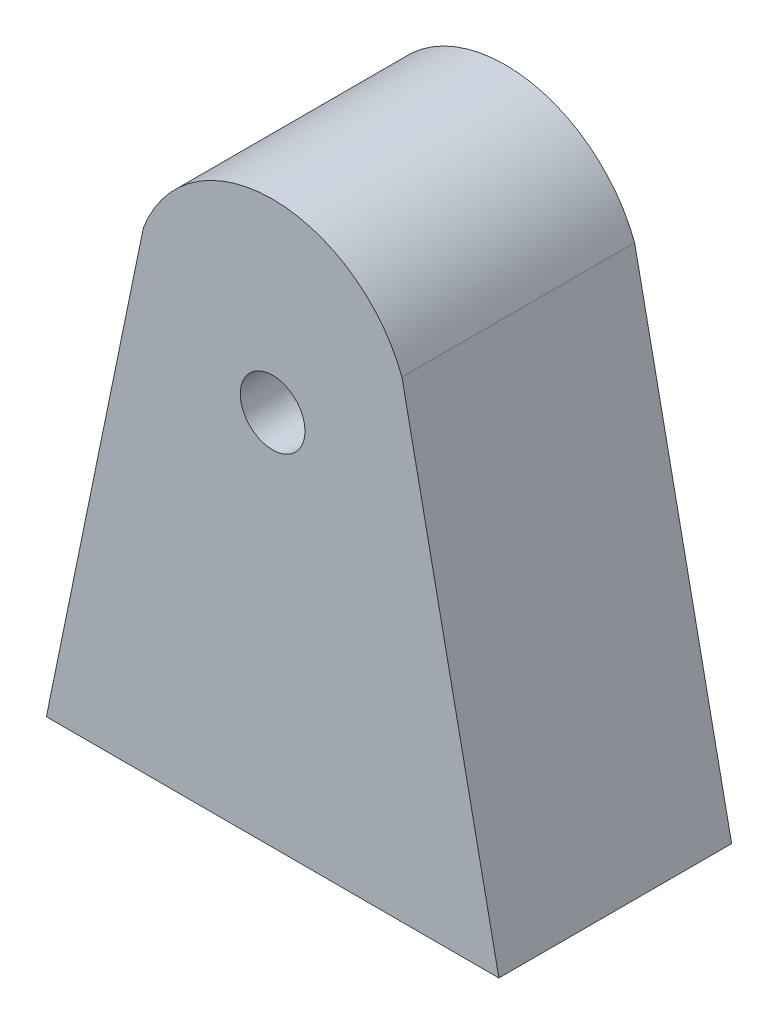
ISO-10303-21;
HEADER;
FILE_DESCRIPTION(('STEP AP214'),'2;1');
FILE_NAME('part.step','',(''),(''),'','','');
FILE_SCHEMA(('AUTOMOTIVE_DESIGN { 1 0 10303 214 1 1 1 1 }'));
ENDSEC;
DATA;
#1=APPLICATION_CONTEXT('core data for automotive mechanical design processes');
#2=APPLICATION_PROTOCOL_DEFINITION('international standard','automotive_design',2000,#1);
#3=PRODUCT_CONTEXT('',#1,'mechanical');
#4=PRODUCT('Part','Part','',(#3));
#5=PRODUCT_RELATED_PRODUCT_CATEGORY('part','',(#4));
#6=PRODUCT_DEFINITION_FORMATION('','',#4);
#7=PRODUCT_DEFINITION_CONTEXT('part definition',#1,'design');
#8=PRODUCT_DEFINITION('design','',#6,#7);
#9=PRODUCT_DEFINITION_SHAPE('','',#8);
#10=(LENGTH_UNIT() NAMED_UNIT(*) SI_UNIT(.MILLI.,.METRE.));
#11=(NAMED_UNIT(*) PLANE_ANGLE_UNIT() SI_UNIT($,.RADIAN.));
#12=(NAMED_UNIT(*) SI_UNIT($,.STERADIAN.) SOLID_ANGLE_UNIT());
#13=UNCERTAINTY_MEASURE_WITH_UNIT(LENGTH_MEASURE(1.E-05),#10,'distance_accuracy_value','');
#14=(GEOMETRIC_REPRESENTATION_CONTEXT(3) GLOBAL_UNCERTAINTY_ASSIGNED_CONTEXT((#13)) GLOBAL_UNIT_ASSIGNED_CONTEXT((#10,
#11,#12)) REPRESENTATION_CONTEXT('',''));
#15=CARTESIAN_POINT('',(0.,0.,0.));
#16=DIRECTION('',(0.,0.,1.));
#17=DIRECTION('',(1.,0.,0.));
#18=AXIS2_PLACEMENT_3D('',#15,#16,#17);
#19=CARTESIAN_POINT('',(-3.43567739367662,-41.9594853665981,22.86));
#20=DIRECTION('',(0.979534918634303,-0.201274298349514,0.));
#21=DIRECTION('',(0.201274298349514,0.979534918634303,0.));
#22=AXIS2_PLACEMENT_3D('',#19,#20,#21);
#23=PLANE('',#22);
#24=DIRECTION('',(0.,0.,1.));
#25=VECTOR('',#24,1.);
#26=CARTESIAN_POINT('',(-3.6912957525805,-43.2034947132637,17.78));
#27=LINE('',#26,#25);
#28=CARTESIAN_POINT('',(-3.6912957525805,-43.2034947132637,17.78));
#29=VERTEX_POINT('',#28);
#30=CARTESIAN_POINT('',(-3.6912957525805,-43.2034947132637,22.86));
#31=VERTEX_POINT('',#30);
#32=EDGE_CURVE('E180',#29,#31,#27,.T.);
#33=ORIENTED_EDGE('',*,*,#32,.F.);
#34=DIRECTION('',(-0.201274298349514,-0.979534918634303,0.));
#35=VECTOR('',#34,1.);
#36=CARTESIAN_POINT('',(-3.43567739367662,-41.9594853665981,17.78));
#37=LINE('',#36,#35);
#38=CARTESIAN_POINT('',(-3.94691411148438,-44.4475040599292,17.78));
#39=VERTEX_POINT('',#38);
#40=EDGE_CURVE('E186',#29,#39,#37,.T.);
#41=ORIENTED_EDGE('',*,*,#40,.T.);
#42=DIRECTION('',(0.,0.,1.));
#43=VECTOR('',#42,1.);
#44=CARTESIAN_POINT('',(-3.94691411148438,-44.4475040599292,22.86));
#45=LINE('',#44,#43);
#46=CARTESIAN_POINT('',(-3.94691411148438,-44.4475040599292,22.86));
#47=VERTEX_POINT('',#46);
#48=EDGE_CURVE('E187',#39,#47,#45,.T.);
#49=ORIENTED_EDGE('',*,*,#48,.T.);
#50=DIRECTION('',(-0.201274298349514,-0.979534918634303,0.));
#51=VECTOR('',#50,1.);
#52=CARTESIAN_POINT('',(-3.43567739367662,-41.9594853665981,22.86));
#53=LINE('',#52,#51);
#54=EDGE_CURVE('E201',#31,#47,#53,.T.);
#55=ORIENTED_EDGE('',*,*,#54,.F.);
#56=EDGE_LOOP('',(#33,#41,#49,#55));
#57=FACE_BOUND('',#56,.T.);
#58=ADVANCED_FACE('F36',(#57),#23,.F.);
#59=CARTESIAN_POINT('',(-1.45889541815325,-44.958740777737,17.78));
#60=DIRECTION('',(-0.201274298349514,-0.979534918634303,0.));
#61=DIRECTION('',(0.979534918634303,-0.201274298349514,0.));
#62=AXIS2_PLACEMENT_3D('',#59,#60,#61);
#63=PLANE('',#62);
#64=ORIENTED_EDGE('',*,*,#48,.F.);
#65=DIRECTION('',(-0.979534918634303,0.201274298349514,0.));
#66=VECTOR('',#65,1.);
#67=CARTESIAN_POINT('',(-1.45889541815325,-44.958740777737,17.78));
#68=LINE('',#67,#66);
#69=CARTESIAN_POINT('',(-6.43493280481551,-43.9362673421214,17.78));
#70=VERTEX_POINT('',#69);
#71=EDGE_CURVE('E226',#39,#70,#68,.T.);
#72=ORIENTED_EDGE('',*,*,#71,.T.);
#73=DIRECTION('',(0.,0.,1.));
#74=VECTOR('',#73,1.);
#75=CARTESIAN_POINT('',(-6.43493280481551,-43.9362673421214,17.78));
#76=LINE('',#75,#74);
#77=CARTESIAN_POINT('',(-6.43493280481551,-43.9362673421214,22.86));
#78=VERTEX_POINT('',#77);
#79=EDGE_CURVE('E215',#70,#78,#76,.T.);
#80=ORIENTED_EDGE('',*,*,#79,.T.);
#81=DIRECTION('',(-0.979534918634303,0.201274298349514,0.));
#82=VECTOR('',#81,1.);
#83=CARTESIAN_POINT('',(-1.45889541815325,-44.958740777737,22.86));
#84=LINE('',#83,#82);
#85=EDGE_CURVE('E224',#47,#78,#84,.T.);
#86=ORIENTED_EDGE('',*,*,#85,.F.);
#87=EDGE_LOOP('',(#64,#72,#80,#86));
#88=FACE_BOUND('',#87,.T.);
#89=ADVANCED_FACE('F309',(#88),#63,.F.);
#90=CARTESIAN_POINT('',(2.48801869333113,-0.511236717807766,45.72));
#91=DIRECTION('',(0.979534918634303,-0.201274298349514,0.));
#92=DIRECTION('',(0.201274298349514,0.979534918634303,0.));
#93=AXIS2_PLACEMENT_3D('',#90,#91,#92);
#94=PLANE('',#93);
#95=DIRECTION('',(0.201274298349514,0.979534918634303,0.));
#96=VECTOR('',#95,1.);
#97=CARTESIAN_POINT('',(2.48801869333114,-0.511236717807768,30.48));
#98=LINE('',#97,#96);
#99=CARTESIAN_POINT('',(-16.4569326660234,-92.71,30.48));
#100=VERTEX_POINT('',#99);
#101=CARTESIAN_POINT('',(2.44652287467715,-0.713183035257189,30.48));
#102=VERTEX_POINT('',#101);
#103=EDGE_CURVE('E237',#100,#102,#98,.T.);
#104=ORIENTED_EDGE('',*,*,#103,.F.);
#105=DIRECTION('',(0.,0.,-1.));
#106=VECTOR('',#105,1.);
#107=CARTESIAN_POINT('',(-16.4569326660234,-92.71,45.72));
#108=LINE('',#107,#106);
#109=CARTESIAN_POINT('',(-16.4569326660234,-92.71,10.16));
#110=VERTEX_POINT('',#109);
#111=EDGE_CURVE('E252',#100,#110,#108,.T.);
#112=ORIENTED_EDGE('',*,*,#111,.T.);
#113=DIRECTION('',(-0.201274298349514,-0.979534918634303,0.));
#114=VECTOR('',#113,1.);
#115=CARTESIAN_POINT('',(1.62779937202775,-4.6976374148176,10.16));
#116=LINE('',#115,#114);
#117=CARTESIAN_POINT('',(2.44652287467714,-0.713183035257189,10.16));
#118=VERTEX_POINT('',#117);
#119=EDGE_CURVE('E248',#118,#110,#116,.T.);
#120=ORIENTED_EDGE('',*,*,#119,.F.);
#121=DIRECTION('',(0.,0.,-1.));
#122=VECTOR('',#121,1.);
#123=CARTESIAN_POINT('',(2.44652287467714,-0.713183035257189,35.56));
#124=LINE('',#123,#122);
#125=EDGE_CURVE('E249',#102,#118,#124,.T.);
#126=ORIENTED_EDGE('',*,*,#125,.F.);
#127=EDGE_LOOP('',(#104,#112,#120,#126));
#128=FACE_BOUND('',#127,.T.);
#129=ORIENTED_EDGE('',*,*,#79,.F.);
#130=DIRECTION('',(0.201274298349514,0.979534918634303,0.));
#131=VECTOR('',#130,1.);
#132=CARTESIAN_POINT('',(-6.43493280481551,-43.9362673421214,17.78));
#133=LINE('',#132,#131);
#134=CARTESIAN_POINT('',(-6.94616952262327,-46.4242860354526,17.78));
#135=VERTEX_POINT('',#134);
#136=EDGE_CURVE('E205',#135,#70,#133,.T.);
#137=ORIENTED_EDGE('',*,*,#136,.F.);
#138=DIRECTION('',(0.,0.,-1.));
#139=VECTOR('',#138,1.);
#140=CARTESIAN_POINT('',(-6.94616952262327,-46.4242860354526,17.78));
#141=LINE('',#140,#139);
#142=CARTESIAN_POINT('',(-6.94616952262328,-46.4242860354526,22.86));
#143=VERTEX_POINT('',#142);
#144=EDGE_CURVE('E209',#143,#135,#141,.T.);
#145=ORIENTED_EDGE('',*,*,#144,.F.);
#146=DIRECTION('',(-0.201274298349515,-0.979534918634303,0.));
#147=VECTOR('',#146,1.);
#148=CARTESIAN_POINT('',(-6.43493280481551,-43.9362673421214,22.86));
#149=LINE('',#148,#147);
#150=EDGE_CURVE('E218',#78,#143,#149,.T.);
#151=ORIENTED_EDGE('',*,*,#150,.F.);
#152=EDGE_LOOP('',(#129,#137,#145,#151));
#153=FACE_BOUND('',#152,.T.);
#154=ADVANCED_FACE('F315',(#128,#153),#94,.T.);
#155=CARTESIAN_POINT('',(69.85,-92.71,45.72));
#156=DIRECTION('',(0.,1.,0.));
#157=DIRECTION('',(0.,0.,1.));
#158=AXIS2_PLACEMENT_3D('',#155,#156,#157);
#159=PLANE('',#158);
#160=ORIENTED_EDGE('',*,*,#111,.F.);
#161=DIRECTION('',(-1.,0.,0.));
#162=VECTOR('',#161,1.);
#163=CARTESIAN_POINT('',(0.,-92.71,30.48));
#164=LINE('',#163,#162);
#165=CARTESIAN_POINT('',(67.2569326660234,-92.71,30.48));
#166=VERTEX_POINT('',#165);
#167=EDGE_CURVE('E243',#166,#100,#164,.T.);
#168=ORIENTED_EDGE('',*,*,#167,.F.);
#169=DIRECTION('',(0.,0.,-1.));
#170=VECTOR('',#169,1.);
#171=CARTESIAN_POINT('',(67.2569326660234,-92.71,45.72));
#172=LINE('',#171,#170);
#173=CARTESIAN_POINT('',(67.2569326660234,-92.71,10.16));
#174=VERTEX_POINT('',#173);
#175=EDGE_CURVE('E255',#166,#174,#172,.T.);
#176=ORIENTED_EDGE('',*,*,#175,.T.);
#177=DIRECTION('',(1.,0.,0.));
#178=VECTOR('',#177,1.);
#179=CARTESIAN_POINT('',(25.4,-92.71,10.16));
#180=LINE('',#179,#178);
#181=EDGE_CURVE('E259',#110,#174,#180,.T.);
#182=ORIENTED_EDGE('',*,*,#181,.F.);
#183=EDGE_LOOP('',(#160,#168,#176,#182));
#184=FACE_BOUND('',#183,.T.);
#185=DIRECTION('',(1.,0.,0.));
#186=VECTOR('',#185,1.);
#187=CARTESIAN_POINT('',(69.85,-92.71,0.));
#188=LINE('',#187,#186);
#189=CARTESIAN_POINT('',(-19.05,-92.71,0.));
#190=VERTEX_POINT('',#189);
#191=CARTESIAN_POINT('',(69.85,-92.71,0.));
#192=VERTEX_POINT('',#191);
#193=EDGE_CURVE('E277',#190,#192,#188,.T.);
#194=ORIENTED_EDGE('',*,*,#193,.T.);
#195=DIRECTION('',(0.,0.,-1.));
#196=VECTOR('',#195,1.);
#197=CARTESIAN_POINT('',(69.85,-92.71,45.72));
#198=LINE('',#197,#196);
#199=CARTESIAN_POINT('',(69.85,-92.71,45.72));
#200=VERTEX_POINT('',#199);
#201=EDGE_CURVE('E281',#200,#192,#198,.T.);
#202=ORIENTED_EDGE('',*,*,#201,.F.);
#203=DIRECTION('',(1.,0.,0.));
#204=VECTOR('',#203,1.);
#205=CARTESIAN_POINT('',(69.85,-92.71,45.72));
#206=LINE('',#205,#204);
#207=CARTESIAN_POINT('',(-19.05,-92.71,45.72));
#208=VERTEX_POINT('',#207);
#209=EDGE_CURVE('E269',#208,#200,#206,.T.);
#210=ORIENTED_EDGE('',*,*,#209,.F.);
#211=DIRECTION('',(0.,0.,-1.));
#212=VECTOR('',#211,1.);
#213=CARTESIAN_POINT('',(-19.05,-92.71,45.72));
#214=LINE('',#213,#212);
#215=EDGE_CURVE('E45',#208,#190,#214,.T.);
#216=ORIENTED_EDGE('',*,*,#215,.T.);
#217=EDGE_LOOP('',(#194,#202,#210,#216));
#218=FACE_BOUND('',#217,.T.);
#219=ADVANCED_FACE('F287',(#184,#218),#159,.F.);
#220=CARTESIAN_POINT('',(25.4,-9.58233617398998,45.72));
#221=DIRECTION('',(0.,0.,-1.));
#222=DIRECTION('',(-1.,0.,0.));
#223=AXIS2_PLACEMENT_3D('',#220,#221,#222);
#224=CYLINDRICAL_SURFACE('',#223,27.1473970492818);
#225=CARTESIAN_POINT('',(25.4,-9.58233617398998,0.));
#226=DIRECTION('',(0.,0.,1.));
#227=DIRECTION('',(-1.,0.,0.));
#228=AXIS2_PLACEMENT_3D('',#225,#226,#227);
#229=CIRCLE('',#228,27.1473970492818);
#230=CARTESIAN_POINT('',(50.8,0.,0.));
#231=VERTEX_POINT('',#230);
#232=CARTESIAN_POINT('',(0.,0.,0.));
#233=VERTEX_POINT('',#232);
#234=EDGE_CURVE('E251',#231,#233,#229,.T.);
#235=ORIENTED_EDGE('',*,*,#234,.T.);
#236=DIRECTION('',(0.,0.,-1.));
#237=VECTOR('',#236,1.);
#238=CARTESIAN_POINT('',(0.,0.,45.72));
#239=LINE('',#238,#237);
#240=CARTESIAN_POINT('',(0.,0.,45.72));
#241=VERTEX_POINT('',#240);
#242=EDGE_CURVE('E11',#241,#233,#239,.T.);
#243=ORIENTED_EDGE('',*,*,#242,.F.);
#244=CARTESIAN_POINT('',(25.4,-9.58233617398998,45.72));
#245=DIRECTION('',(0.,0.,1.));
#246=DIRECTION('',(-1.,0.,0.));
#247=AXIS2_PLACEMENT_3D('',#244,#245,#246);
#248=CIRCLE('',#247,27.1473970492818);
#249=CARTESIAN_POINT('',(50.8,0.,45.72));
#250=VERTEX_POINT('',#249);
#251=EDGE_CURVE('E266',#250,#241,#248,.T.);
#252=ORIENTED_EDGE('',*,*,#251,.F.);
#253=DIRECTION('',(0.,0.,-1.));
#254=VECTOR('',#253,1.);
#255=CARTESIAN_POINT('',(50.8,0.,45.72));
#256=LINE('',#255,#254);
#257=EDGE_CURVE('E272',#250,#231,#256,.T.);
#258=ORIENTED_EDGE('',*,*,#257,.T.);
#259=EDGE_LOOP('',(#235,#243,#252,#258));
#260=FACE_BOUND('',#259,.T.);
#261=ADVANCED_FACE('F38',(#260),#224,.T.);
#262=CARTESIAN_POINT('',(0.,0.,45.72));
#263=DIRECTION('',(0.979534918634303,-0.201274298349514,0.));
#264=DIRECTION('',(0.201274298349514,0.979534918634303,0.));
#265=AXIS2_PLACEMENT_3D('',#262,#263,#264);
#266=PLANE('',#265);
#267=DIRECTION('',(-0.201274298349514,-0.979534918634303,0.));
#268=VECTOR('',#267,1.);
#269=CARTESIAN_POINT('',(0.,0.,0.));
#270=LINE('',#269,#268);
#271=EDGE_CURVE('E275',#233,#190,#270,.T.);
#272=ORIENTED_EDGE('',*,*,#271,.T.);
#273=ORIENTED_EDGE('',*,*,#215,.F.);
#274=DIRECTION('',(-0.201274298349514,-0.979534918634303,0.));
#275=VECTOR('',#274,1.);
#276=CARTESIAN_POINT('',(0.,0.,45.72));
#277=LINE('',#276,#275);
#278=EDGE_CURVE('E89',#241,#208,#277,.T.);
#279=ORIENTED_EDGE('',*,*,#278,.F.);
#280=ORIENTED_EDGE('',*,*,#242,.T.);
#281=EDGE_LOOP('',(#272,#273,#279,#280));
#282=FACE_BOUND('',#281,.T.);
#283=ADVANCED_FACE('F298',(#282),#266,.F.);
#284=CARTESIAN_POINT('',(50.8,0.,45.72));
#285=DIRECTION('',(-0.979534918634303,-0.201274298349514,0.));
#286=DIRECTION('',(0.201274298349514,-0.979534918634303,0.));
#287=AXIS2_PLACEMENT_3D('',#284,#285,#286);
#288=PLANE('',#287);
#289=DIRECTION('',(-0.201274298349514,0.979534918634303,0.));
#290=VECTOR('',#289,1.);
#291=CARTESIAN_POINT('',(50.8,0.,0.));
#292=LINE('',#291,#290);
#293=EDGE_CURVE('E82',#192,#231,#292,.T.);
#294=ORIENTED_EDGE('',*,*,#293,.T.);
#295=ORIENTED_EDGE('',*,*,#257,.F.);
#296=DIRECTION('',(-0.201274298349514,0.979534918634303,0.));
#297=VECTOR('',#296,1.);
#298=CARTESIAN_POINT('',(50.8,0.,45.72));
#299=LINE('',#298,#297);
#300=EDGE_CURVE('E61',#200,#250,#299,.T.);
#301=ORIENTED_EDGE('',*,*,#300,.F.);
#302=ORIENTED_EDGE('',*,*,#201,.T.);
#303=EDGE_LOOP('',(#294,#295,#301,#302));
#304=FACE_BOUND('',#303,.T.);
#305=ADVANCED_FACE('F295',(#304),#288,.F.);
#306=CARTESIAN_POINT('',(25.4,-9.58233617398998,45.72));
#307=DIRECTION('',(0.,0.,-1.));
#308=DIRECTION('',(-1.,0.,0.));
#309=AXIS2_PLACEMENT_3D('',#306,#307,#308);
#310=PLANE('',#309);
#311=CARTESIAN_POINT('',(25.3999999999993,-18.7380855059969,45.72));
#312=DIRECTION('',(0.,0.,-1.));
#313=DIRECTION('',(-1.,0.,0.));
#314=AXIS2_PLACEMENT_3D('',#311,#312,#313);
#315=CIRCLE('',#314,6.35);
#316=CARTESIAN_POINT('',(19.0499999999993,-18.7380855059969,45.72));
#317=VERTEX_POINT('',#316);
#318=EDGE_CURVE('E229',#317,#317,#315,.T.);
#319=ORIENTED_EDGE('',*,*,#318,.T.);
#320=EDGE_LOOP('',(#319));
#321=FACE_BOUND('',#320,.T.);
#322=ORIENTED_EDGE('',*,*,#251,.T.);
#323=ORIENTED_EDGE('',*,*,#278,.T.);
#324=ORIENTED_EDGE('',*,*,#209,.T.);
#325=ORIENTED_EDGE('',*,*,#300,.T.);
#326=EDGE_LOOP('',(#322,#323,#324,#325));
#327=FACE_BOUND('',#326,.T.);
#328=ADVANCED_FACE('F297',(#321,#327),#310,.F.);
#329=CARTESIAN_POINT('',(25.4,-9.58233617398998,0.));
#330=DIRECTION('',(0.,0.,-1.));
#331=DIRECTION('',(-1.,0.,0.));
#332=AXIS2_PLACEMENT_3D('',#329,#330,#331);
#333=PLANE('',#332);
#334=CARTESIAN_POINT('',(25.3999999999993,-18.7380855059969,0.));
#335=DIRECTION('',(0.,0.,-1.));
#336=DIRECTION('',(-1.,0.,0.));
#337=AXIS2_PLACEMENT_3D('',#334,#335,#336);
#338=CIRCLE('',#337,6.35);
#339=CARTESIAN_POINT('',(19.0499999999993,-18.7380855059969,0.));
#340=VERTEX_POINT('',#339);
#341=EDGE_CURVE('E228',#340,#340,#338,.T.);
#342=ORIENTED_EDGE('',*,*,#341,.F.);
#343=EDGE_LOOP('',(#342));
#344=FACE_BOUND('',#343,.T.);
#345=ORIENTED_EDGE('',*,*,#234,.F.);
#346=ORIENTED_EDGE('',*,*,#293,.F.);
#347=ORIENTED_EDGE('',*,*,#193,.F.);
#348=ORIENTED_EDGE('',*,*,#271,.F.);
#349=EDGE_LOOP('',(#345,#346,#347,#348));
#350=FACE_BOUND('',#349,.T.);
#351=ADVANCED_FACE('F291',(#344,#350),#333,.T.);
#352=CARTESIAN_POINT('',(25.4,-9.58233617398998,45.72));
#353=DIRECTION('',(0.,0.,-1.));
#354=DIRECTION('',(-1.,0.,0.));
#355=AXIS2_PLACEMENT_3D('',#352,#353,#354);
#356=CYLINDRICAL_SURFACE('',#355,24.6073970492819);
#357=CARTESIAN_POINT('',(25.4,-9.58233617398998,30.48));
#358=DIRECTION('',(0.,0.,-1.));
#359=DIRECTION('',(-1.,0.,0.));
#360=AXIS2_PLACEMENT_3D('',#357,#358,#359);
#361=CIRCLE('',#360,24.6073970492819);
#362=CARTESIAN_POINT('',(48.3534771253228,-0.713183035257182,30.48));
#363=VERTEX_POINT('',#362);
#364=EDGE_CURVE('E239',#102,#363,#361,.T.);
#365=ORIENTED_EDGE('',*,*,#364,.F.);
#366=ORIENTED_EDGE('',*,*,#125,.T.);
#367=CARTESIAN_POINT('',(25.4,-9.58233617398998,10.16));
#368=DIRECTION('',(0.,0.,-1.));
#369=DIRECTION('',(-1.,0.,0.));
#370=AXIS2_PLACEMENT_3D('',#367,#368,#369);
#371=CIRCLE('',#370,24.6073970492819);
#372=CARTESIAN_POINT('',(48.3534771253229,-0.713183035257182,10.16));
#373=VERTEX_POINT('',#372);
#374=EDGE_CURVE('E245',#373,#118,#371,.F.);
#375=ORIENTED_EDGE('',*,*,#374,.F.);
#376=DIRECTION('',(0.,0.,-1.));
#377=VECTOR('',#376,1.);
#378=CARTESIAN_POINT('',(48.3534771253229,-0.713183035257182,35.56));
#379=LINE('',#378,#377);
#380=EDGE_CURVE('E253',#363,#373,#379,.T.);
#381=ORIENTED_EDGE('',*,*,#380,.F.);
#382=EDGE_LOOP('',(#365,#366,#375,#381));
#383=FACE_BOUND('',#382,.T.);
#384=ADVANCED_FACE('F345',(#383),#356,.F.);
#385=CARTESIAN_POINT('',(48.3119813066689,-0.511236717807766,45.72));
#386=DIRECTION('',(-0.979534918634303,-0.201274298349514,0.));
#387=DIRECTION('',(0.201274298349514,-0.979534918634303,0.));
#388=AXIS2_PLACEMENT_3D('',#385,#386,#387);
#389=PLANE('',#388);
#390=DIRECTION('',(0.201274298349514,-0.979534918634303,0.));
#391=VECTOR('',#390,1.);
#392=CARTESIAN_POINT('',(46.2540050733235,9.5042476178062,30.48));
#393=LINE('',#392,#391);
#394=EDGE_CURVE('E241',#363,#166,#393,.T.);
#395=ORIENTED_EDGE('',*,*,#394,.F.);
#396=ORIENTED_EDGE('',*,*,#380,.T.);
#397=DIRECTION('',(-0.201274298349514,0.979534918634303,0.));
#398=VECTOR('',#397,1.);
#399=CARTESIAN_POINT('',(49.1722006279723,-4.6976374148176,10.16));
#400=LINE('',#399,#398);
#401=EDGE_CURVE('E256',#174,#373,#400,.T.);
#402=ORIENTED_EDGE('',*,*,#401,.F.);
#403=ORIENTED_EDGE('',*,*,#175,.F.);
#404=EDGE_LOOP('',(#395,#396,#402,#403));
#405=FACE_BOUND('',#404,.T.);
#406=ADVANCED_FACE('F348',(#405),#389,.T.);
#407=CARTESIAN_POINT('',(25.4,-9.58233617398998,10.16));
#408=DIRECTION('',(0.,0.,-1.));
#409=DIRECTION('',(-1.,0.,0.));
#410=AXIS2_PLACEMENT_3D('',#407,#408,#409);
#411=PLANE('',#410);
#412=CARTESIAN_POINT('',(25.3999999999993,-18.7380855059969,10.16));
#413=DIRECTION('',(0.,0.,-1.));
#414=DIRECTION('',(-1.,0.,0.));
#415=AXIS2_PLACEMENT_3D('',#412,#413,#414);
#416=CIRCLE('',#415,6.35);
#417=CARTESIAN_POINT('',(19.0499999999993,-18.7380855059969,10.16));
#418=VERTEX_POINT('',#417);
#419=EDGE_CURVE('E234',#418,#418,#416,.T.);
#420=ORIENTED_EDGE('',*,*,#419,.T.);
#421=EDGE_LOOP('',(#420));
#422=FACE_BOUND('',#421,.T.);
#423=ORIENTED_EDGE('',*,*,#374,.T.);
#424=ORIENTED_EDGE('',*,*,#119,.T.);
#425=ORIENTED_EDGE('',*,*,#181,.T.);
#426=ORIENTED_EDGE('',*,*,#401,.T.);
#427=EDGE_LOOP('',(#423,#424,#425,#426));
#428=FACE_BOUND('',#427,.T.);
#429=ADVANCED_FACE('F343',(#422,#428),#411,.F.);
#430=CARTESIAN_POINT('',(0.,0.,30.48));
#431=DIRECTION('',(0.,0.,-1.));
#432=DIRECTION('',(-1.,0.,0.));
#433=AXIS2_PLACEMENT_3D('',#430,#431,#432);
#434=PLANE('',#433);
#435=CARTESIAN_POINT('',(25.3999999999993,-18.7380855059969,30.48));
#436=DIRECTION('',(0.,0.,-1.));
#437=DIRECTION('',(-1.,0.,0.));
#438=AXIS2_PLACEMENT_3D('',#435,#436,#437);
#439=CIRCLE('',#438,6.35);
#440=CARTESIAN_POINT('',(19.0499999999993,-18.7380855059969,30.48));
#441=VERTEX_POINT('',#440);
#442=EDGE_CURVE('E40',#441,#441,#439,.T.);
#443=ORIENTED_EDGE('',*,*,#442,.F.);
#444=EDGE_LOOP('',(#443));
#445=FACE_BOUND('',#444,.T.);
#446=ORIENTED_EDGE('',*,*,#103,.T.);
#447=ORIENTED_EDGE('',*,*,#364,.T.);
#448=ORIENTED_EDGE('',*,*,#394,.T.);
#449=ORIENTED_EDGE('',*,*,#167,.T.);
#450=EDGE_LOOP('',(#446,#447,#448,#449));
#451=FACE_BOUND('',#450,.T.);
#452=ADVANCED_FACE('F339',(#445,#451),#434,.T.);
#453=CARTESIAN_POINT('',(25.3999999999993,-18.7380855059969,45.72));
#454=DIRECTION('',(0.,0.,-1.));
#455=DIRECTION('',(-1.,0.,0.));
#456=AXIS2_PLACEMENT_3D('',#453,#454,#455);
#457=CYLINDRICAL_SURFACE('',#456,6.35);
#458=ORIENTED_EDGE('',*,*,#442,.T.);
#459=EDGE_LOOP('',(#458));
#460=FACE_BOUND('',#459,.T.);
#461=ORIENTED_EDGE('',*,*,#318,.F.);
#462=EDGE_LOOP('',(#461));
#463=FACE_BOUND('',#462,.T.);
#464=ADVANCED_FACE('F336',(#460,#463),#457,.F.);
#465=ORIENTED_EDGE('',*,*,#341,.T.);
#466=EDGE_LOOP('',(#465));
#467=FACE_BOUND('',#466,.T.);
#468=ORIENTED_EDGE('',*,*,#419,.F.);
#469=EDGE_LOOP('',(#468));
#470=FACE_BOUND('',#469,.T.);
#471=ADVANCED_FACE('F335',(#467,#470),#457,.F.);
#472=CARTESIAN_POINT('',(-1.45889541815325,-44.958740777737,17.78));
#473=DIRECTION('',(0.,0.,1.));
#474=DIRECTION('',(1.,0.,0.));
#475=AXIS2_PLACEMENT_3D('',#472,#473,#474);
#476=PLANE('',#475);
#477=ORIENTED_EDGE('',*,*,#136,.T.);
#478=ORIENTED_EDGE('',*,*,#71,.F.);
#479=ORIENTED_EDGE('',*,*,#40,.F.);
#480=DIRECTION('',(0.979534918634303,-0.201274298349514,0.));
#481=VECTOR('',#480,1.);
#482=CARTESIAN_POINT('',(-4.93530509924606,-42.9478763543598,17.78));
#483=LINE('',#482,#481);
#484=CARTESIAN_POINT('',(-4.93530509924606,-42.9478763543598,17.78));
#485=VERTEX_POINT('',#484);
#486=EDGE_CURVE('E163',#485,#29,#483,.T.);
#487=ORIENTED_EDGE('',*,*,#486,.F.);
#488=DIRECTION('',(-0.201274298349514,-0.979534918634303,0.));
#489=VECTOR('',#488,1.);
#490=CARTESIAN_POINT('',(-4.67968674034218,-41.7038670076942,17.78));
#491=LINE('',#490,#489);
#492=CARTESIAN_POINT('',(-4.67968674034218,-41.7038670076942,17.78));
#493=VERTEX_POINT('',#492);
#494=EDGE_CURVE('E171',#493,#485,#491,.T.);
#495=ORIENTED_EDGE('',*,*,#494,.F.);
#496=DIRECTION('',(-0.979534918634303,0.201274298349516,0.));
#497=VECTOR('',#496,1.);
#498=CARTESIAN_POINT('',(-0.947658700345485,-42.4707220844059,17.78));
#499=LINE('',#498,#497);
#500=CARTESIAN_POINT('',(-0.947658700345485,-42.4707220844059,17.78));
#501=VERTEX_POINT('',#500);
#502=EDGE_CURVE('E197',#501,#493,#499,.T.);
#503=ORIENTED_EDGE('',*,*,#502,.F.);
#504=DIRECTION('',(0.201274298349514,0.979534918634303,0.));
#505=VECTOR('',#504,1.);
#506=CARTESIAN_POINT('',(-1.45889541815325,-44.958740777737,17.78));
#507=LINE('',#506,#505);
#508=CARTESIAN_POINT('',(-1.97013213596101,-47.4467594710681,17.78));
#509=VERTEX_POINT('',#508);
#510=EDGE_CURVE('E206',#509,#501,#507,.T.);
#511=ORIENTED_EDGE('',*,*,#510,.F.);
#512=DIRECTION('',(-0.979534918634303,0.201274298349514,0.));
#513=VECTOR('',#512,1.);
#514=CARTESIAN_POINT('',(-1.97013213596101,-47.4467594710681,17.78));
#515=LINE('',#514,#513);
#516=EDGE_CURVE('E213',#509,#135,#515,.T.);
#517=ORIENTED_EDGE('',*,*,#516,.T.);
#518=EDGE_LOOP('',(#477,#478,#479,#487,#495,#503,#511,#517));
#519=FACE_BOUND('',#518,.T.);
#520=ADVANCED_FACE('F184',(#519),#476,.F.);
#521=CARTESIAN_POINT('',(-1.45889541815325,-44.958740777737,22.86));
#522=DIRECTION('',(0.,0.,-1.));
#523=DIRECTION('',(-1.,0.,0.));
#524=AXIS2_PLACEMENT_3D('',#521,#522,#523);
#525=PLANE('',#524);
#526=ORIENTED_EDGE('',*,*,#150,.T.);
#527=DIRECTION('',(-0.979534918634303,0.201274298349514,0.));
#528=VECTOR('',#527,1.);
#529=CARTESIAN_POINT('',(-1.97013213596101,-47.4467594710681,22.86));
#530=LINE('',#529,#528);
#531=CARTESIAN_POINT('',(-1.97013213596101,-47.4467594710681,22.86));
#532=VERTEX_POINT('',#531);
#533=EDGE_CURVE('E52',#532,#143,#530,.T.);
#534=ORIENTED_EDGE('',*,*,#533,.F.);
#535=DIRECTION('',(-0.201274298349515,-0.979534918634303,0.));
#536=VECTOR('',#535,1.);
#537=CARTESIAN_POINT('',(-1.45889541815325,-44.958740777737,22.86));
#538=LINE('',#537,#536);
#539=CARTESIAN_POINT('',(-0.947658700345485,-42.4707220844059,22.86));
#540=VERTEX_POINT('',#539);
#541=EDGE_CURVE('E208',#540,#532,#538,.T.);
#542=ORIENTED_EDGE('',*,*,#541,.F.);
#543=DIRECTION('',(0.979534918634303,-0.201274298349516,0.));
#544=VECTOR('',#543,1.);
#545=CARTESIAN_POINT('',(-0.947658700345485,-42.4707220844059,22.86));
#546=LINE('',#545,#544);
#547=CARTESIAN_POINT('',(-4.67968674034218,-41.7038670076942,22.86));
#548=VERTEX_POINT('',#547);
#549=EDGE_CURVE('E199',#548,#540,#546,.T.);
#550=ORIENTED_EDGE('',*,*,#549,.F.);
#551=DIRECTION('',(0.201274298349514,0.979534918634303,0.));
#552=VECTOR('',#551,1.);
#553=CARTESIAN_POINT('',(-4.67968674034218,-41.7038670076942,22.86));
#554=LINE('',#553,#552);
#555=CARTESIAN_POINT('',(-4.93530509924606,-42.9478763543598,22.86));
#556=VERTEX_POINT('',#555);
#557=EDGE_CURVE('E170',#556,#548,#554,.T.);
#558=ORIENTED_EDGE('',*,*,#557,.F.);
#559=DIRECTION('',(0.979534918634303,-0.201274298349514,0.));
#560=VECTOR('',#559,1.);
#561=CARTESIAN_POINT('',(-4.93530509924606,-42.9478763543598,22.86));
#562=LINE('',#561,#560);
#563=EDGE_CURVE('E166',#556,#31,#562,.T.);
#564=ORIENTED_EDGE('',*,*,#563,.T.);
#565=ORIENTED_EDGE('',*,*,#54,.T.);
#566=ORIENTED_EDGE('',*,*,#85,.T.);
#567=EDGE_LOOP('',(#526,#534,#542,#550,#558,#564,#565,#566));
#568=FACE_BOUND('',#567,.T.);
#569=ADVANCED_FACE('F329',(#568),#525,.F.);
#570=CARTESIAN_POINT('',(-1.97013213596101,-47.4467594710681,17.78));
#571=DIRECTION('',(0.201274298349514,0.979534918634303,0.));
#572=DIRECTION('',(-0.979534918634303,0.201274298349514,0.));
#573=AXIS2_PLACEMENT_3D('',#570,#571,#572);
#574=PLANE('',#573);
#575=ORIENTED_EDGE('',*,*,#144,.T.);
#576=ORIENTED_EDGE('',*,*,#516,.F.);
#577=DIRECTION('',(0.,0.,-1.));
#578=VECTOR('',#577,1.);
#579=CARTESIAN_POINT('',(-1.97013213596101,-47.4467594710681,17.78));
#580=LINE('',#579,#578);
#581=EDGE_CURVE('E211',#532,#509,#580,.T.);
#582=ORIENTED_EDGE('',*,*,#581,.F.);
#583=ORIENTED_EDGE('',*,*,#533,.T.);
#584=EDGE_LOOP('',(#575,#576,#582,#583));
#585=FACE_BOUND('',#584,.T.);
#586=ADVANCED_FACE('F325',(#585),#574,.F.);
#587=CARTESIAN_POINT('',(7.4640560799934,-1.5337101534233,0.));
#588=DIRECTION('',(-0.979534918634303,0.201274298349514,0.));
#589=DIRECTION('',(-0.201274298349514,-0.979534918634303,0.));
#590=AXIS2_PLACEMENT_3D('',#587,#588,#589);
#591=PLANE('',#590);
#592=ORIENTED_EDGE('',*,*,#510,.T.);
#593=DIRECTION('',(0.,0.,-1.));
#594=VECTOR('',#593,1.);
#595=CARTESIAN_POINT('',(-0.947658700345485,-42.4707220844059,22.86));
#596=LINE('',#595,#594);
#597=EDGE_CURVE('E190',#540,#501,#596,.T.);
#598=ORIENTED_EDGE('',*,*,#597,.F.);
#599=ORIENTED_EDGE('',*,*,#541,.T.);
#600=ORIENTED_EDGE('',*,*,#581,.T.);
#601=EDGE_LOOP('',(#592,#598,#599,#600));
#602=FACE_BOUND('',#601,.T.);
#603=ADVANCED_FACE('F322',(#602),#591,.F.);
#604=CARTESIAN_POINT('',(-8.41171478033893,-40.9370119309825,0.));
#605=DIRECTION('',(0.201274298349516,0.979534918634303,0.));
#606=DIRECTION('',(-0.979534918634303,0.201274298349516,0.));
#607=AXIS2_PLACEMENT_3D('',#604,#605,#606);
#608=PLANE('',#607);
#609=ORIENTED_EDGE('',*,*,#597,.T.);
#610=ORIENTED_EDGE('',*,*,#502,.T.);
#611=DIRECTION('',(0.,0.,-1.));
#612=VECTOR('',#611,1.);
#613=CARTESIAN_POINT('',(-4.67968674034218,-41.7038670076942,17.78));
#614=LINE('',#613,#612);
#615=EDGE_CURVE('E177',#548,#493,#614,.T.);
#616=ORIENTED_EDGE('',*,*,#615,.F.);
#617=ORIENTED_EDGE('',*,*,#549,.T.);
#618=EDGE_LOOP('',(#609,#610,#616,#617));
#619=FACE_BOUND('',#618,.T.);
#620=ADVANCED_FACE('F320',(#619),#608,.T.);
#621=CARTESIAN_POINT('',(-4.93530509924606,-42.9478763543598,17.78));
#622=DIRECTION('',(0.201274298349514,0.979534918634303,0.));
#623=DIRECTION('',(-0.979534918634303,0.201274298349514,0.));
#624=AXIS2_PLACEMENT_3D('',#621,#622,#623);
#625=PLANE('',#624);
#626=ORIENTED_EDGE('',*,*,#32,.T.);
#627=ORIENTED_EDGE('',*,*,#563,.F.);
#628=DIRECTION('',(0.,0.,1.));
#629=VECTOR('',#628,1.);
#630=CARTESIAN_POINT('',(-4.93530509924606,-42.9478763543598,17.78));
#631=LINE('',#630,#629);
#632=EDGE_CURVE('E159',#485,#556,#631,.T.);
#633=ORIENTED_EDGE('',*,*,#632,.F.);
#634=ORIENTED_EDGE('',*,*,#486,.T.);
#635=EDGE_LOOP('',(#626,#627,#633,#634));
#636=FACE_BOUND('',#635,.T.);
#637=ADVANCED_FACE('F161',(#636),#625,.F.);
#638=CARTESIAN_POINT('',(3.73202803999669,-0.766855076711647,0.));
#639=DIRECTION('',(-0.979534918634303,0.201274298349514,0.));
#640=DIRECTION('',(-0.201274298349514,-0.979534918634303,0.));
#641=AXIS2_PLACEMENT_3D('',#638,#639,#640);
#642=PLANE('',#641);
#643=ORIENTED_EDGE('',*,*,#494,.T.);
#644=ORIENTED_EDGE('',*,*,#632,.T.);
#645=ORIENTED_EDGE('',*,*,#557,.T.);
#646=ORIENTED_EDGE('',*,*,#615,.T.);
#647=EDGE_LOOP('',(#643,#644,#645,#646));
#648=FACE_BOUND('',#647,.T.);
#649=ADVANCED_FACE('F175',(#648),#642,.T.);
#650=CLOSED_SHELL('',(#58,#89,#154,#219,#261,#283,#305,#328,#351,#384,#406,#429,#452,#464,#471,
#520,#569,#586,#603,#620,#637,#649));
#651=MANIFOLD_SOLID_BREP('B2',#650);
#652=ADVANCED_BREP_SHAPE_REPRESENTATION('',(#18,#651),#14);
#653=SHAPE_DEFINITION_REPRESENTATION(#9,#652);
ENDSEC;
END-ISO-10303-21;
